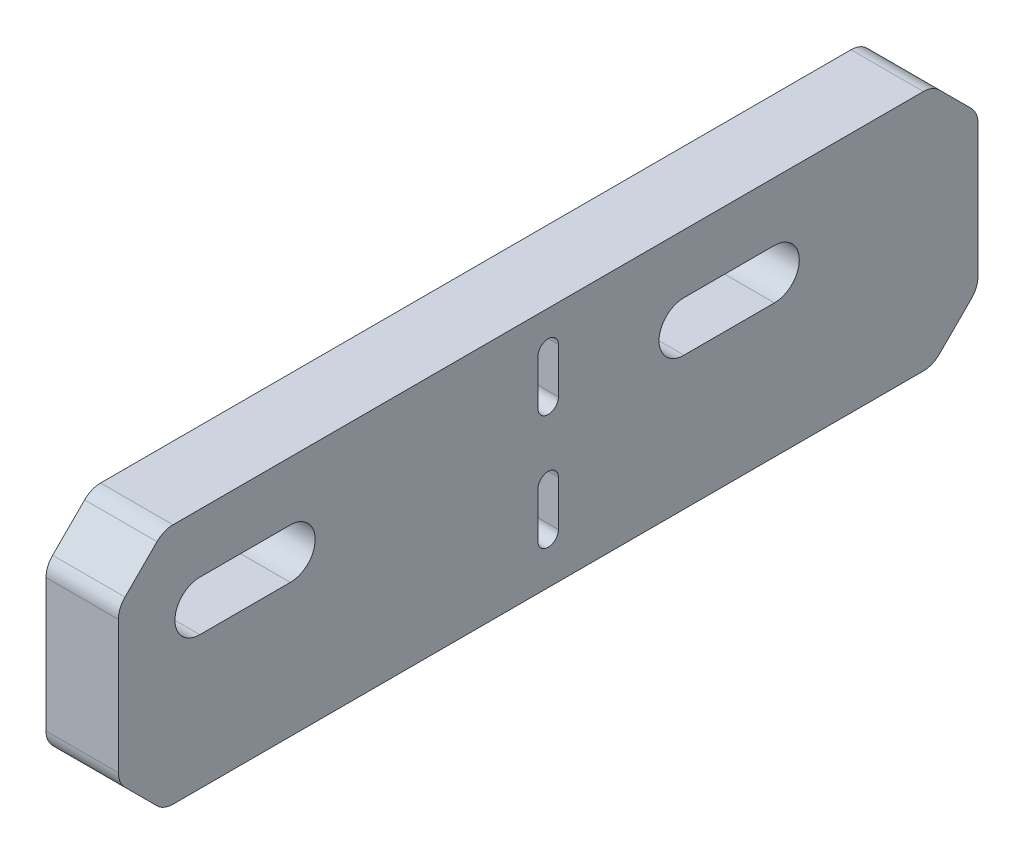
ISO-10303-21;
HEADER;
FILE_DESCRIPTION(('STEP AP214'),'2;1');
FILE_NAME('part.step','',(''),(''),'','','');
FILE_SCHEMA(('AUTOMOTIVE_DESIGN { 1 0 10303 214 1 1 1 1 }'));
ENDSEC;
DATA;
#1=APPLICATION_CONTEXT('core data for automotive mechanical design processes');
#2=APPLICATION_PROTOCOL_DEFINITION('international standard','automotive_design',2000,#1);
#3=PRODUCT_CONTEXT('',#1,'mechanical');
#4=PRODUCT('Part','Part','',(#3));
#5=PRODUCT_RELATED_PRODUCT_CATEGORY('part','',(#4));
#6=PRODUCT_DEFINITION_FORMATION('','',#4);
#7=PRODUCT_DEFINITION_CONTEXT('part definition',#1,'design');
#8=PRODUCT_DEFINITION('design','',#6,#7);
#9=PRODUCT_DEFINITION_SHAPE('','',#8);
#10=(LENGTH_UNIT() NAMED_UNIT(*) SI_UNIT(.MILLI.,.METRE.));
#11=(NAMED_UNIT(*) PLANE_ANGLE_UNIT() SI_UNIT($,.RADIAN.));
#12=(NAMED_UNIT(*) SI_UNIT($,.STERADIAN.) SOLID_ANGLE_UNIT());
#13=UNCERTAINTY_MEASURE_WITH_UNIT(LENGTH_MEASURE(1.E-05),#10,'distance_accuracy_value','');
#14=(GEOMETRIC_REPRESENTATION_CONTEXT(3) GLOBAL_UNCERTAINTY_ASSIGNED_CONTEXT((#13)) GLOBAL_UNIT_ASSIGNED_CONTEXT((#10,
#11,#12)) REPRESENTATION_CONTEXT('',''));
#15=CARTESIAN_POINT('',(0.,0.,0.));
#16=DIRECTION('',(0.,0.,1.));
#17=DIRECTION('',(1.,0.,0.));
#18=AXIS2_PLACEMENT_3D('',#15,#16,#17);
#19=CARTESIAN_POINT('',(8.,10.875,40.));
#20=DIRECTION('',(0.,-1.,0.));
#21=DIRECTION('',(0.,0.,-1.));
#22=AXIS2_PLACEMENT_3D('',#19,#20,#21);
#23=PLANE('',#22);
#24=DIRECTION('',(0.,0.,1.));
#25=VECTOR('',#24,1.);
#26=CARTESIAN_POINT('',(8.,10.875,40.));
#27=LINE('',#26,#25);
#28=CARTESIAN_POINT('',(8.,10.875,-41.4644660940673));
#29=VERTEX_POINT('',#28);
#30=CARTESIAN_POINT('',(8.,10.875,41.4644660940673));
#31=VERTEX_POINT('',#30);
#32=EDGE_CURVE('E389',#29,#31,#27,.T.);
#33=ORIENTED_EDGE('',*,*,#32,.F.);
#34=DIRECTION('',(-1.,0.,0.));
#35=VECTOR('',#34,1.);
#36=CARTESIAN_POINT('',(0.,10.875,-41.4644660940673));
#37=LINE('',#36,#35);
#38=CARTESIAN_POINT('',(0.,10.875,-41.4644660940673));
#39=VERTEX_POINT('',#38);
#40=EDGE_CURVE('E471',#29,#39,#37,.T.);
#41=ORIENTED_EDGE('',*,*,#40,.T.);
#42=DIRECTION('',(0.,0.,1.));
#43=VECTOR('',#42,1.);
#44=CARTESIAN_POINT('',(0.,10.875,40.));
#45=LINE('',#44,#43);
#46=CARTESIAN_POINT('',(0.,10.875,41.4644660940673));
#47=VERTEX_POINT('',#46);
#48=EDGE_CURVE('E382',#39,#47,#45,.T.);
#49=ORIENTED_EDGE('',*,*,#48,.T.);
#50=DIRECTION('',(1.,0.,0.));
#51=VECTOR('',#50,1.);
#52=CARTESIAN_POINT('',(8.,10.875,41.4644660940673));
#53=LINE('',#52,#51);
#54=EDGE_CURVE('E468',#47,#31,#53,.T.);
#55=ORIENTED_EDGE('',*,*,#54,.T.);
#56=EDGE_LOOP('',(#33,#41,#49,#55));
#57=FACE_BOUND('',#56,.T.);
#58=ADVANCED_FACE('F33',(#57),#23,.F.);
#59=CARTESIAN_POINT('',(8.,0.,0.));
#60=DIRECTION('',(1.,0.,0.));
#61=DIRECTION('',(0.,0.,-1.));
#62=AXIS2_PLACEMENT_3D('',#59,#60,#61);
#63=PLANE('',#62);
#64=CARTESIAN_POINT('',(8.,6.825,0.));
#65=DIRECTION('',(1.,0.,0.));
#66=DIRECTION('',(0.,0.,-1.));
#67=AXIS2_PLACEMENT_3D('',#64,#65,#66);
#68=CIRCLE('',#67,1.1303);
#69=CARTESIAN_POINT('',(8.,6.825,-1.1303));
#70=VERTEX_POINT('',#69);
#71=CARTESIAN_POINT('',(8.,6.825,1.1303));
#72=VERTEX_POINT('',#71);
#73=EDGE_CURVE('E282',#70,#72,#68,.T.);
#74=ORIENTED_EDGE('',*,*,#73,.F.);
#75=DIRECTION('',(0.,1.,0.));
#76=VECTOR('',#75,1.);
#77=CARTESIAN_POINT('',(8.,0.,-1.1303));
#78=LINE('',#77,#76);
#79=CARTESIAN_POINT('',(8.,1.825,-1.1303));
#80=VERTEX_POINT('',#79);
#81=EDGE_CURVE('E275',#80,#70,#78,.T.);
#82=ORIENTED_EDGE('',*,*,#81,.F.);
#83=CARTESIAN_POINT('',(8.,1.825,0.));
#84=DIRECTION('',(1.,0.,0.));
#85=DIRECTION('',(0.,0.,-1.));
#86=AXIS2_PLACEMENT_3D('',#83,#84,#85);
#87=CIRCLE('',#86,1.1303);
#88=CARTESIAN_POINT('',(8.,1.825,1.1303));
#89=VERTEX_POINT('',#88);
#90=EDGE_CURVE('E250',#89,#80,#87,.T.);
#91=ORIENTED_EDGE('',*,*,#90,.F.);
#92=DIRECTION('',(0.,-1.,0.));
#93=VECTOR('',#92,1.);
#94=CARTESIAN_POINT('',(8.,0.,1.1303));
#95=LINE('',#94,#93);
#96=EDGE_CURVE('E279',#72,#89,#95,.T.);
#97=ORIENTED_EDGE('',*,*,#96,.F.);
#98=EDGE_LOOP('',(#74,#82,#91,#97));
#99=FACE_BOUND('',#98,.T.);
#100=CARTESIAN_POINT('',(8.,-5.875,0.));
#101=DIRECTION('',(1.,0.,0.));
#102=DIRECTION('',(0.,0.,-1.));
#103=AXIS2_PLACEMENT_3D('',#100,#101,#102);
#104=CIRCLE('',#103,1.1303);
#105=CARTESIAN_POINT('',(8.,-5.875,-1.1303));
#106=VERTEX_POINT('',#105);
#107=CARTESIAN_POINT('',(8.,-5.875,1.1303));
#108=VERTEX_POINT('',#107);
#109=EDGE_CURVE('E311',#106,#108,#104,.T.);
#110=ORIENTED_EDGE('',*,*,#109,.F.);
#111=DIRECTION('',(0.,1.,0.));
#112=VECTOR('',#111,1.);
#113=CARTESIAN_POINT('',(8.,0.,-1.1303));
#114=LINE('',#113,#112);
#115=CARTESIAN_POINT('',(8.,-10.875,-1.1303));
#116=VERTEX_POINT('',#115);
#117=EDGE_CURVE('E299',#116,#106,#114,.T.);
#118=ORIENTED_EDGE('',*,*,#117,.F.);
#119=CARTESIAN_POINT('',(8.,-10.875,0.));
#120=DIRECTION('',(1.,0.,0.));
#121=DIRECTION('',(0.,0.,-1.));
#122=AXIS2_PLACEMENT_3D('',#119,#120,#121);
#123=CIRCLE('',#122,1.1303);
#124=CARTESIAN_POINT('',(8.,-10.875,1.1303));
#125=VERTEX_POINT('',#124);
#126=EDGE_CURVE('E309',#125,#116,#123,.T.);
#127=ORIENTED_EDGE('',*,*,#126,.F.);
#128=DIRECTION('',(0.,-1.,0.));
#129=VECTOR('',#128,1.);
#130=CARTESIAN_POINT('',(8.,0.,1.1303));
#131=LINE('',#130,#129);
#132=EDGE_CURVE('E307',#108,#125,#131,.T.);
#133=ORIENTED_EDGE('',*,*,#132,.F.);
#134=EDGE_LOOP('',(#110,#118,#127,#133));
#135=FACE_BOUND('',#134,.T.);
#136=CARTESIAN_POINT('',(8.,1.62499999999999,-15.));
#137=DIRECTION('',(1.,0.,0.));
#138=DIRECTION('',(0.,0.,-1.));
#139=AXIS2_PLACEMENT_3D('',#136,#137,#138);
#140=CIRCLE('',#139,2.74999999999999);
#141=CARTESIAN_POINT('',(8.,4.37499999999998,-15.));
#142=VERTEX_POINT('',#141);
#143=CARTESIAN_POINT('',(8.,-1.12499999999999,-15.));
#144=VERTEX_POINT('',#143);
#145=EDGE_CURVE('E340',#142,#144,#140,.T.);
#146=ORIENTED_EDGE('',*,*,#145,.F.);
#147=DIRECTION('',(0.,0.,1.));
#148=VECTOR('',#147,1.);
#149=CARTESIAN_POINT('',(8.,4.37499999999998,0.));
#150=LINE('',#149,#148);
#151=CARTESIAN_POINT('',(8.,4.37499999999998,-25.));
#152=VERTEX_POINT('',#151);
#153=EDGE_CURVE('E328',#152,#142,#150,.T.);
#154=ORIENTED_EDGE('',*,*,#153,.F.);
#155=CARTESIAN_POINT('',(8.,1.62499999999999,-25.));
#156=DIRECTION('',(1.,0.,0.));
#157=DIRECTION('',(0.,0.,-1.));
#158=AXIS2_PLACEMENT_3D('',#155,#156,#157);
#159=CIRCLE('',#158,2.74999999999999);
#160=CARTESIAN_POINT('',(8.,-1.12499999999999,-25.));
#161=VERTEX_POINT('',#160);
#162=EDGE_CURVE('E338',#161,#152,#159,.T.);
#163=ORIENTED_EDGE('',*,*,#162,.F.);
#164=DIRECTION('',(0.,0.,-1.));
#165=VECTOR('',#164,1.);
#166=CARTESIAN_POINT('',(8.,-1.12499999999999,0.));
#167=LINE('',#166,#165);
#168=EDGE_CURVE('E336',#144,#161,#167,.T.);
#169=ORIENTED_EDGE('',*,*,#168,.F.);
#170=EDGE_LOOP('',(#146,#154,#163,#169));
#171=FACE_BOUND('',#170,.T.);
#172=CARTESIAN_POINT('',(8.,1.625,38.5));
#173=DIRECTION('',(1.,0.,0.));
#174=DIRECTION('',(0.,0.,-1.));
#175=AXIS2_PLACEMENT_3D('',#172,#173,#174);
#176=CIRCLE('',#175,2.74999999999999);
#177=CARTESIAN_POINT('',(8.,4.37499999999999,38.5));
#178=VERTEX_POINT('',#177);
#179=CARTESIAN_POINT('',(8.,-1.12499999999999,38.5));
#180=VERTEX_POINT('',#179);
#181=EDGE_CURVE('E369',#178,#180,#176,.T.);
#182=ORIENTED_EDGE('',*,*,#181,.F.);
#183=DIRECTION('',(0.,0.,1.));
#184=VECTOR('',#183,1.);
#185=CARTESIAN_POINT('',(8.,4.37499999999997,0.));
#186=LINE('',#185,#184);
#187=CARTESIAN_POINT('',(8.,4.37499999999998,28.5));
#188=VERTEX_POINT('',#187);
#189=EDGE_CURVE('E357',#188,#178,#186,.T.);
#190=ORIENTED_EDGE('',*,*,#189,.F.);
#191=CARTESIAN_POINT('',(8.,1.625,28.5));
#192=DIRECTION('',(1.,0.,0.));
#193=DIRECTION('',(0.,0.,-1.));
#194=AXIS2_PLACEMENT_3D('',#191,#192,#193);
#195=CIRCLE('',#194,2.74999999999999);
#196=CARTESIAN_POINT('',(8.,-1.12499999999999,28.5));
#197=VERTEX_POINT('',#196);
#198=EDGE_CURVE('E367',#197,#188,#195,.T.);
#199=ORIENTED_EDGE('',*,*,#198,.F.);
#200=DIRECTION('',(0.,0.,-1.));
#201=VECTOR('',#200,1.);
#202=CARTESIAN_POINT('',(8.,-1.125,0.));
#203=LINE('',#202,#201);
#204=EDGE_CURVE('E365',#180,#197,#203,.T.);
#205=ORIENTED_EDGE('',*,*,#204,.F.);
#206=EDGE_LOOP('',(#182,#190,#199,#205));
#207=FACE_BOUND('',#206,.T.);
#208=DIRECTION('',(0.,0.,1.));
#209=VECTOR('',#208,1.);
#210=CARTESIAN_POINT('',(8.,-15.875,47.5));
#211=LINE('',#210,#209);
#212=CARTESIAN_POINT('',(8.,-15.875,-41.4644660940673));
#213=VERTEX_POINT('',#212);
#214=CARTESIAN_POINT('',(8.,-15.875,41.4644660940673));
#215=VERTEX_POINT('',#214);
#216=EDGE_CURVE('E375',#213,#215,#211,.T.);
#217=ORIENTED_EDGE('',*,*,#216,.F.);
#218=CARTESIAN_POINT('',(8.,-13.375,-41.4644660940673));
#219=DIRECTION('',(1.,0.,0.));
#220=DIRECTION('',(0.,0.,-1.));
#221=AXIS2_PLACEMENT_3D('',#218,#219,#220);
#222=CIRCLE('',#221,2.5);
#223=CARTESIAN_POINT('',(8.,-15.1427669529664,-43.2322330470336));
#224=VERTEX_POINT('',#223);
#225=EDGE_CURVE('E437',#213,#224,#222,.T.);
#226=ORIENTED_EDGE('',*,*,#225,.T.);
#227=DIRECTION('',(0.,-0.707106781186547,0.707106781186548));
#228=VECTOR('',#227,1.);
#229=CARTESIAN_POINT('',(8.,-29.1875,-29.1874999999999));
#230=LINE('',#229,#228);
#231=CARTESIAN_POINT('',(8.,-11.6072330470336,-46.7677669529664));
#232=VERTEX_POINT('',#231);
#233=EDGE_CURVE('E411',#224,#232,#230,.F.);
#234=ORIENTED_EDGE('',*,*,#233,.T.);
#235=CARTESIAN_POINT('',(8.,-9.83946609406727,-45.));
#236=DIRECTION('',(1.,0.,0.));
#237=DIRECTION('',(0.,0.,-1.));
#238=AXIS2_PLACEMENT_3D('',#235,#236,#237);
#239=CIRCLE('',#238,2.5);
#240=CARTESIAN_POINT('',(8.,-9.83946609406727,-47.5));
#241=VERTEX_POINT('',#240);
#242=EDGE_CURVE('E435',#232,#241,#239,.T.);
#243=ORIENTED_EDGE('',*,*,#242,.T.);
#244=DIRECTION('',(0.,-1.,0.));
#245=VECTOR('',#244,1.);
#246=CARTESIAN_POINT('',(8.,-15.875,-47.5));
#247=LINE('',#246,#245);
#248=CARTESIAN_POINT('',(8.,4.83946609406727,-47.5));
#249=VERTEX_POINT('',#248);
#250=EDGE_CURVE('E372',#249,#241,#247,.T.);
#251=ORIENTED_EDGE('',*,*,#250,.F.);
#252=CARTESIAN_POINT('',(8.,4.83946609406728,-45.));
#253=DIRECTION('',(1.,0.,0.));
#254=DIRECTION('',(0.,0.,-1.));
#255=AXIS2_PLACEMENT_3D('',#252,#253,#254);
#256=CIRCLE('',#255,2.5);
#257=CARTESIAN_POINT('',(8.,6.60723304703364,-46.7677669529664));
#258=VERTEX_POINT('',#257);
#259=EDGE_CURVE('E433',#249,#258,#256,.T.);
#260=ORIENTED_EDGE('',*,*,#259,.T.);
#261=DIRECTION('',(0.,0.707106781186548,0.707106781186547));
#262=VECTOR('',#261,1.);
#263=CARTESIAN_POINT('',(8.,26.6875,-26.6875));
#264=LINE('',#263,#262);
#265=CARTESIAN_POINT('',(8.,10.1427669529664,-43.2322330470336));
#266=VERTEX_POINT('',#265);
#267=EDGE_CURVE('E414',#258,#266,#264,.T.);
#268=ORIENTED_EDGE('',*,*,#267,.T.);
#269=CARTESIAN_POINT('',(8.,8.375,-41.4644660940673));
#270=DIRECTION('',(1.,0.,0.));
#271=DIRECTION('',(0.,0.,-1.));
#272=AXIS2_PLACEMENT_3D('',#269,#270,#271);
#273=CIRCLE('',#272,2.5);
#274=EDGE_CURVE('E431',#266,#29,#273,.T.);
#275=ORIENTED_EDGE('',*,*,#274,.T.);
#276=ORIENTED_EDGE('',*,*,#32,.T.);
#277=CARTESIAN_POINT('',(8.,8.375,41.4644660940673));
#278=DIRECTION('',(1.,0.,0.));
#279=DIRECTION('',(0.,0.,-1.));
#280=AXIS2_PLACEMENT_3D('',#277,#278,#279);
#281=CIRCLE('',#280,2.5);
#282=CARTESIAN_POINT('',(8.,10.1427669529664,43.2322330470336));
#283=VERTEX_POINT('',#282);
#284=EDGE_CURVE('E429',#31,#283,#281,.T.);
#285=ORIENTED_EDGE('',*,*,#284,.T.);
#286=DIRECTION('',(0.,-0.707106781186546,0.707106781186549));
#287=VECTOR('',#286,1.);
#288=CARTESIAN_POINT('',(8.,26.6875,26.6874999999999));
#289=LINE('',#288,#287);
#290=CARTESIAN_POINT('',(8.,6.60723304703367,46.7677669529664));
#291=VERTEX_POINT('',#290);
#292=EDGE_CURVE('E408',#283,#291,#289,.T.);
#293=ORIENTED_EDGE('',*,*,#292,.T.);
#294=CARTESIAN_POINT('',(8.,4.8394660940673,45.));
#295=DIRECTION('',(1.,0.,0.));
#296=DIRECTION('',(0.,0.,-1.));
#297=AXIS2_PLACEMENT_3D('',#294,#295,#296);
#298=CIRCLE('',#297,2.5);
#299=CARTESIAN_POINT('',(8.,4.8394660940673,47.5));
#300=VERTEX_POINT('',#299);
#301=EDGE_CURVE('E427',#291,#300,#298,.T.);
#302=ORIENTED_EDGE('',*,*,#301,.T.);
#303=DIRECTION('',(0.,1.,0.));
#304=VECTOR('',#303,1.);
#305=CARTESIAN_POINT('',(8.,10.875,47.5));
#306=LINE('',#305,#304);
#307=CARTESIAN_POINT('',(8.,-9.83946609406725,47.5));
#308=VERTEX_POINT('',#307);
#309=EDGE_CURVE('E379',#308,#300,#306,.T.);
#310=ORIENTED_EDGE('',*,*,#309,.F.);
#311=CARTESIAN_POINT('',(8.,-9.83946609406725,45.));
#312=DIRECTION('',(1.,0.,0.));
#313=DIRECTION('',(0.,0.,-1.));
#314=AXIS2_PLACEMENT_3D('',#311,#312,#313);
#315=CIRCLE('',#314,2.5);
#316=CARTESIAN_POINT('',(8.,-11.6072330470336,46.7677669529664));
#317=VERTEX_POINT('',#316);
#318=EDGE_CURVE('E425',#308,#317,#315,.T.);
#319=ORIENTED_EDGE('',*,*,#318,.T.);
#320=DIRECTION('',(0.,0.707106781186549,0.707106781186546));
#321=VECTOR('',#320,1.);
#322=CARTESIAN_POINT('',(8.,-29.1875,29.1875000000001));
#323=LINE('',#322,#321);
#324=CARTESIAN_POINT('',(8.,-15.1427669529663,43.2322330470337));
#325=VERTEX_POINT('',#324);
#326=EDGE_CURVE('E405',#317,#325,#323,.F.);
#327=ORIENTED_EDGE('',*,*,#326,.T.);
#328=CARTESIAN_POINT('',(8.,-13.375,41.4644660940673));
#329=DIRECTION('',(1.,0.,0.));
#330=DIRECTION('',(0.,0.,-1.));
#331=AXIS2_PLACEMENT_3D('',#328,#329,#330);
#332=CIRCLE('',#331,2.5);
#333=EDGE_CURVE('E423',#325,#215,#332,.T.);
#334=ORIENTED_EDGE('',*,*,#333,.T.);
#335=EDGE_LOOP('',(#217,#226,#234,#243,#251,#260,#268,#275,#276,#285,#293,#302,#310,#319,#327,#334));
#336=FACE_BOUND('',#335,.T.);
#337=ADVANCED_FACE('F492',(#99,#135,#171,#207,#336),#63,.T.);
#338=CARTESIAN_POINT('',(0.,0.,0.));
#339=DIRECTION('',(1.,0.,0.));
#340=DIRECTION('',(0.,0.,-1.));
#341=AXIS2_PLACEMENT_3D('',#338,#339,#340);
#342=PLANE('',#341);
#343=DIRECTION('',(0.,0.707106781186547,-0.707106781186548));
#344=VECTOR('',#343,1.);
#345=CARTESIAN_POINT('',(0.,-10.875,-47.5));
#346=LINE('',#345,#344);
#347=CARTESIAN_POINT('',(0.,-11.6072330470336,-46.7677669529664));
#348=VERTEX_POINT('',#347);
#349=CARTESIAN_POINT('',(0.,-15.1427669529664,-43.2322330470336));
#350=VERTEX_POINT('',#349);
#351=EDGE_CURVE('E399',#348,#350,#346,.F.);
#352=ORIENTED_EDGE('',*,*,#351,.T.);
#353=CARTESIAN_POINT('',(0.,-13.375,-41.4644660940673));
#354=DIRECTION('',(1.,0.,0.));
#355=DIRECTION('',(0.,0.,-1.));
#356=AXIS2_PLACEMENT_3D('',#353,#354,#355);
#357=CIRCLE('',#356,2.5);
#358=CARTESIAN_POINT('',(0.,-15.875,-41.4644660940673));
#359=VERTEX_POINT('',#358);
#360=EDGE_CURVE('E456',#350,#359,#357,.F.);
#361=ORIENTED_EDGE('',*,*,#360,.T.);
#362=DIRECTION('',(0.,0.,1.));
#363=VECTOR('',#362,1.);
#364=CARTESIAN_POINT('',(0.,-15.875,47.5));
#365=LINE('',#364,#363);
#366=CARTESIAN_POINT('',(0.,-15.875,41.4644660940673));
#367=VERTEX_POINT('',#366);
#368=EDGE_CURVE('E385',#359,#367,#365,.T.);
#369=ORIENTED_EDGE('',*,*,#368,.T.);
#370=CARTESIAN_POINT('',(0.,-13.375,41.4644660940673));
#371=DIRECTION('',(1.,0.,0.));
#372=DIRECTION('',(0.,0.,-1.));
#373=AXIS2_PLACEMENT_3D('',#370,#371,#372);
#374=CIRCLE('',#373,2.5);
#375=CARTESIAN_POINT('',(0.,-15.1427669529663,43.2322330470337));
#376=VERTEX_POINT('',#375);
#377=EDGE_CURVE('E443',#367,#376,#374,.F.);
#378=ORIENTED_EDGE('',*,*,#377,.T.);
#379=DIRECTION('',(0.,-0.707106781186549,-0.707106781186546));
#380=VECTOR('',#379,1.);
#381=CARTESIAN_POINT('',(0.,-15.875,42.5));
#382=LINE('',#381,#380);
#383=CARTESIAN_POINT('',(0.,-11.6072330470336,46.7677669529664));
#384=VERTEX_POINT('',#383);
#385=EDGE_CURVE('E392',#376,#384,#382,.F.);
#386=ORIENTED_EDGE('',*,*,#385,.T.);
#387=CARTESIAN_POINT('',(0.,-9.83946609406725,45.));
#388=DIRECTION('',(1.,0.,0.));
#389=DIRECTION('',(0.,0.,-1.));
#390=AXIS2_PLACEMENT_3D('',#387,#388,#389);
#391=CIRCLE('',#390,2.5);
#392=CARTESIAN_POINT('',(0.,-9.83946609406725,47.5));
#393=VERTEX_POINT('',#392);
#394=EDGE_CURVE('E445',#384,#393,#391,.F.);
#395=ORIENTED_EDGE('',*,*,#394,.T.);
#396=DIRECTION('',(0.,1.,0.));
#397=VECTOR('',#396,1.);
#398=CARTESIAN_POINT('',(0.,10.875,47.5));
#399=LINE('',#398,#397);
#400=CARTESIAN_POINT('',(0.,4.8394660940673,47.5));
#401=VERTEX_POINT('',#400);
#402=EDGE_CURVE('E376',#393,#401,#399,.T.);
#403=ORIENTED_EDGE('',*,*,#402,.T.);
#404=CARTESIAN_POINT('',(0.,4.8394660940673,45.));
#405=DIRECTION('',(1.,0.,0.));
#406=DIRECTION('',(0.,0.,-1.));
#407=AXIS2_PLACEMENT_3D('',#404,#405,#406);
#408=CIRCLE('',#407,2.5);
#409=CARTESIAN_POINT('',(0.,6.60723304703367,46.7677669529664));
#410=VERTEX_POINT('',#409);
#411=EDGE_CURVE('E55',#401,#410,#408,.F.);
#412=ORIENTED_EDGE('',*,*,#411,.T.);
#413=DIRECTION('',(0.,0.707106781186546,-0.707106781186549));
#414=VECTOR('',#413,1.);
#415=CARTESIAN_POINT('',(0.,5.87500000000003,47.5));
#416=LINE('',#415,#414);
#417=CARTESIAN_POINT('',(0.,10.1427669529664,43.2322330470336));
#418=VERTEX_POINT('',#417);
#419=EDGE_CURVE('E397',#410,#418,#416,.T.);
#420=ORIENTED_EDGE('',*,*,#419,.T.);
#421=CARTESIAN_POINT('',(0.,8.375,41.4644660940673));
#422=DIRECTION('',(1.,0.,0.));
#423=DIRECTION('',(0.,0.,-1.));
#424=AXIS2_PLACEMENT_3D('',#421,#422,#423);
#425=CIRCLE('',#424,2.5);
#426=EDGE_CURVE('E448',#418,#47,#425,.F.);
#427=ORIENTED_EDGE('',*,*,#426,.T.);
#428=ORIENTED_EDGE('',*,*,#48,.F.);
#429=CARTESIAN_POINT('',(0.,8.375,-41.4644660940673));
#430=DIRECTION('',(1.,0.,0.));
#431=DIRECTION('',(0.,0.,-1.));
#432=AXIS2_PLACEMENT_3D('',#429,#430,#431);
#433=CIRCLE('',#432,2.5);
#434=CARTESIAN_POINT('',(0.,10.1427669529664,-43.2322330470336));
#435=VERTEX_POINT('',#434);
#436=EDGE_CURVE('E450',#39,#435,#433,.F.);
#437=ORIENTED_EDGE('',*,*,#436,.T.);
#438=DIRECTION('',(0.,-0.707106781186548,-0.707106781186547));
#439=VECTOR('',#438,1.);
#440=CARTESIAN_POINT('',(0.,10.875,-42.5));
#441=LINE('',#440,#439);
#442=CARTESIAN_POINT('',(0.,6.60723304703364,-46.7677669529664));
#443=VERTEX_POINT('',#442);
#444=EDGE_CURVE('E402',#435,#443,#441,.T.);
#445=ORIENTED_EDGE('',*,*,#444,.T.);
#446=CARTESIAN_POINT('',(0.,4.83946609406728,-45.));
#447=DIRECTION('',(1.,0.,0.));
#448=DIRECTION('',(0.,0.,-1.));
#449=AXIS2_PLACEMENT_3D('',#446,#447,#448);
#450=CIRCLE('',#449,2.5);
#451=CARTESIAN_POINT('',(0.,4.83946609406727,-47.5));
#452=VERTEX_POINT('',#451);
#453=EDGE_CURVE('E452',#443,#452,#450,.F.);
#454=ORIENTED_EDGE('',*,*,#453,.T.);
#455=DIRECTION('',(0.,-1.,0.));
#456=VECTOR('',#455,1.);
#457=CARTESIAN_POINT('',(0.,-15.875,-47.5));
#458=LINE('',#457,#456);
#459=CARTESIAN_POINT('',(0.,-9.83946609406727,-47.5));
#460=VERTEX_POINT('',#459);
#461=EDGE_CURVE('E371',#452,#460,#458,.T.);
#462=ORIENTED_EDGE('',*,*,#461,.T.);
#463=CARTESIAN_POINT('',(0.,-9.83946609406727,-45.));
#464=DIRECTION('',(1.,0.,0.));
#465=DIRECTION('',(0.,0.,-1.));
#466=AXIS2_PLACEMENT_3D('',#463,#464,#465);
#467=CIRCLE('',#466,2.5);
#468=EDGE_CURVE('E454',#460,#348,#467,.F.);
#469=ORIENTED_EDGE('',*,*,#468,.T.);
#470=EDGE_LOOP('',(#352,#361,#369,#378,#386,#395,#403,#412,#420,#427,#428,#437,#445,#454,#462,#469));
#471=FACE_BOUND('',#470,.T.);
#472=DIRECTION('',(0.,-1.,0.));
#473=VECTOR('',#472,1.);
#474=CARTESIAN_POINT('',(0.,-5.875,-1.1303));
#475=LINE('',#474,#473);
#476=CARTESIAN_POINT('',(0.,-5.875,-1.1303));
#477=VERTEX_POINT('',#476);
#478=CARTESIAN_POINT('',(0.,-10.875,-1.1303));
#479=VERTEX_POINT('',#478);
#480=EDGE_CURVE('E287',#477,#479,#475,.T.);
#481=ORIENTED_EDGE('',*,*,#480,.F.);
#482=CARTESIAN_POINT('',(0.,-5.875,0.));
#483=DIRECTION('',(-1.,0.,0.));
#484=DIRECTION('',(0.,0.,1.));
#485=AXIS2_PLACEMENT_3D('',#482,#483,#484);
#486=CIRCLE('',#485,1.1303);
#487=CARTESIAN_POINT('',(0.,-5.875,1.1303));
#488=VERTEX_POINT('',#487);
#489=EDGE_CURVE('E284',#488,#477,#486,.T.);
#490=ORIENTED_EDGE('',*,*,#489,.F.);
#491=DIRECTION('',(0.,1.,0.));
#492=VECTOR('',#491,1.);
#493=CARTESIAN_POINT('',(0.,-5.875,1.1303));
#494=LINE('',#493,#492);
#495=CARTESIAN_POINT('',(0.,-10.875,1.1303));
#496=VERTEX_POINT('',#495);
#497=EDGE_CURVE('E293',#496,#488,#494,.T.);
#498=ORIENTED_EDGE('',*,*,#497,.F.);
#499=CARTESIAN_POINT('',(0.,-10.875,0.));
#500=DIRECTION('',(-1.,0.,0.));
#501=DIRECTION('',(0.,0.,1.));
#502=AXIS2_PLACEMENT_3D('',#499,#500,#501);
#503=CIRCLE('',#502,1.1303);
#504=EDGE_CURVE('E290',#479,#496,#503,.T.);
#505=ORIENTED_EDGE('',*,*,#504,.F.);
#506=EDGE_LOOP('',(#481,#490,#498,#505));
#507=FACE_BOUND('',#506,.T.);
#508=DIRECTION('',(0.,-1.,0.));
#509=VECTOR('',#508,1.);
#510=CARTESIAN_POINT('',(0.,6.825,-1.1303));
#511=LINE('',#510,#509);
#512=CARTESIAN_POINT('',(0.,6.825,-1.1303));
#513=VERTEX_POINT('',#512);
#514=CARTESIAN_POINT('',(0.,1.825,-1.1303));
#515=VERTEX_POINT('',#514);
#516=EDGE_CURVE('E257',#513,#515,#511,.T.);
#517=ORIENTED_EDGE('',*,*,#516,.F.);
#518=CARTESIAN_POINT('',(0.,6.825,0.));
#519=DIRECTION('',(-1.,0.,0.));
#520=DIRECTION('',(0.,0.,1.));
#521=AXIS2_PLACEMENT_3D('',#518,#519,#520);
#522=CIRCLE('',#521,1.1303);
#523=CARTESIAN_POINT('',(0.,6.825,1.1303));
#524=VERTEX_POINT('',#523);
#525=EDGE_CURVE('E263',#524,#513,#522,.T.);
#526=ORIENTED_EDGE('',*,*,#525,.F.);
#527=DIRECTION('',(0.,1.,0.));
#528=VECTOR('',#527,1.);
#529=CARTESIAN_POINT('',(0.,6.825,1.1303));
#530=LINE('',#529,#528);
#531=CARTESIAN_POINT('',(0.,1.825,1.1303));
#532=VERTEX_POINT('',#531);
#533=EDGE_CURVE('E267',#532,#524,#530,.T.);
#534=ORIENTED_EDGE('',*,*,#533,.F.);
#535=CARTESIAN_POINT('',(0.,1.825,0.));
#536=DIRECTION('',(-1.,0.,0.));
#537=DIRECTION('',(0.,0.,1.));
#538=AXIS2_PLACEMENT_3D('',#535,#536,#537);
#539=CIRCLE('',#538,1.1303);
#540=EDGE_CURVE('E247',#515,#532,#539,.T.);
#541=ORIENTED_EDGE('',*,*,#540,.F.);
#542=EDGE_LOOP('',(#517,#526,#534,#541));
#543=FACE_BOUND('',#542,.T.);
#544=DIRECTION('',(0.,0.,-1.));
#545=VECTOR('',#544,1.);
#546=CARTESIAN_POINT('',(0.,4.37499999999998,-15.));
#547=LINE('',#546,#545);
#548=CARTESIAN_POINT('',(0.,4.37499999999998,-15.));
#549=VERTEX_POINT('',#548);
#550=CARTESIAN_POINT('',(0.,4.37499999999998,-25.));
#551=VERTEX_POINT('',#550);
#552=EDGE_CURVE('E316',#549,#551,#547,.T.);
#553=ORIENTED_EDGE('',*,*,#552,.F.);
#554=CARTESIAN_POINT('',(0.,1.62499999999999,-15.));
#555=DIRECTION('',(-1.,0.,0.));
#556=DIRECTION('',(0.,0.,1.));
#557=AXIS2_PLACEMENT_3D('',#554,#555,#556);
#558=CIRCLE('',#557,2.74999999999999);
#559=CARTESIAN_POINT('',(0.,-1.12499999999999,-15.));
#560=VERTEX_POINT('',#559);
#561=EDGE_CURVE('E313',#560,#549,#558,.T.);
#562=ORIENTED_EDGE('',*,*,#561,.F.);
#563=DIRECTION('',(0.,0.,1.));
#564=VECTOR('',#563,1.);
#565=CARTESIAN_POINT('',(0.,-1.12499999999999,-15.));
#566=LINE('',#565,#564);
#567=CARTESIAN_POINT('',(0.,-1.12499999999999,-25.));
#568=VERTEX_POINT('',#567);
#569=EDGE_CURVE('E322',#568,#560,#566,.T.);
#570=ORIENTED_EDGE('',*,*,#569,.F.);
#571=CARTESIAN_POINT('',(0.,1.62499999999999,-25.));
#572=DIRECTION('',(-1.,0.,0.));
#573=DIRECTION('',(0.,0.,1.));
#574=AXIS2_PLACEMENT_3D('',#571,#572,#573);
#575=CIRCLE('',#574,2.74999999999999);
#576=EDGE_CURVE('E319',#551,#568,#575,.T.);
#577=ORIENTED_EDGE('',*,*,#576,.F.);
#578=EDGE_LOOP('',(#553,#562,#570,#577));
#579=FACE_BOUND('',#578,.T.);
#580=DIRECTION('',(0.,0.,-1.));
#581=VECTOR('',#580,1.);
#582=CARTESIAN_POINT('',(0.,4.37499999999999,38.5));
#583=LINE('',#582,#581);
#584=CARTESIAN_POINT('',(0.,4.37499999999999,38.5));
#585=VERTEX_POINT('',#584);
#586=CARTESIAN_POINT('',(0.,4.37499999999998,28.5));
#587=VERTEX_POINT('',#586);
#588=EDGE_CURVE('E345',#585,#587,#583,.T.);
#589=ORIENTED_EDGE('',*,*,#588,.F.);
#590=CARTESIAN_POINT('',(0.,1.625,38.5));
#591=DIRECTION('',(-1.,0.,0.));
#592=DIRECTION('',(0.,0.,1.));
#593=AXIS2_PLACEMENT_3D('',#590,#591,#592);
#594=CIRCLE('',#593,2.74999999999999);
#595=CARTESIAN_POINT('',(0.,-1.12499999999999,38.5));
#596=VERTEX_POINT('',#595);
#597=EDGE_CURVE('E342',#596,#585,#594,.T.);
#598=ORIENTED_EDGE('',*,*,#597,.F.);
#599=DIRECTION('',(0.,0.,1.));
#600=VECTOR('',#599,1.);
#601=CARTESIAN_POINT('',(0.,-1.12499999999999,38.5));
#602=LINE('',#601,#600);
#603=CARTESIAN_POINT('',(0.,-1.12499999999999,28.5));
#604=VERTEX_POINT('',#603);
#605=EDGE_CURVE('E351',#604,#596,#602,.T.);
#606=ORIENTED_EDGE('',*,*,#605,.F.);
#607=CARTESIAN_POINT('',(0.,1.625,28.5));
#608=DIRECTION('',(-1.,0.,0.));
#609=DIRECTION('',(0.,0.,1.));
#610=AXIS2_PLACEMENT_3D('',#607,#608,#609);
#611=CIRCLE('',#610,2.74999999999999);
#612=EDGE_CURVE('E348',#587,#604,#611,.T.);
#613=ORIENTED_EDGE('',*,*,#612,.F.);
#614=EDGE_LOOP('',(#589,#598,#606,#613));
#615=FACE_BOUND('',#614,.T.);
#616=ADVANCED_FACE('F265',(#471,#507,#543,#579,#615),#342,.F.);
#617=CARTESIAN_POINT('',(8.,10.875,47.5));
#618=DIRECTION('',(0.,0.,1.));
#619=DIRECTION('',(1.,0.,0.));
#620=AXIS2_PLACEMENT_3D('',#617,#618,#619);
#621=PLANE('',#620);
#622=ORIENTED_EDGE('',*,*,#309,.T.);
#623=DIRECTION('',(-1.,0.,0.));
#624=VECTOR('',#623,1.);
#625=CARTESIAN_POINT('',(8.,4.8394660940673,47.5));
#626=LINE('',#625,#624);
#627=EDGE_CURVE('E480',#300,#401,#626,.T.);
#628=ORIENTED_EDGE('',*,*,#627,.T.);
#629=ORIENTED_EDGE('',*,*,#402,.F.);
#630=DIRECTION('',(-1.,0.,0.));
#631=VECTOR('',#630,1.);
#632=CARTESIAN_POINT('',(8.,-9.83946609406725,47.5));
#633=LINE('',#632,#631);
#634=EDGE_CURVE('E477',#393,#308,#633,.F.);
#635=ORIENTED_EDGE('',*,*,#634,.T.);
#636=EDGE_LOOP('',(#622,#628,#629,#635));
#637=FACE_BOUND('',#636,.T.);
#638=ADVANCED_FACE('F545',(#637),#621,.T.);
#639=CARTESIAN_POINT('',(8.,-15.875,47.5));
#640=DIRECTION('',(0.,-1.,0.));
#641=DIRECTION('',(0.,0.,-1.));
#642=AXIS2_PLACEMENT_3D('',#639,#640,#641);
#643=PLANE('',#642);
#644=ORIENTED_EDGE('',*,*,#368,.F.);
#645=DIRECTION('',(-1.,0.,0.));
#646=VECTOR('',#645,1.);
#647=CARTESIAN_POINT('',(8.,-15.875,-41.4644660940673));
#648=LINE('',#647,#646);
#649=EDGE_CURVE('E420',#359,#213,#648,.F.);
#650=ORIENTED_EDGE('',*,*,#649,.T.);
#651=ORIENTED_EDGE('',*,*,#216,.T.);
#652=DIRECTION('',(1.,0.,0.));
#653=VECTOR('',#652,1.);
#654=CARTESIAN_POINT('',(8.,-15.875,41.4644660940673));
#655=LINE('',#654,#653);
#656=EDGE_CURVE('E417',#215,#367,#655,.F.);
#657=ORIENTED_EDGE('',*,*,#656,.T.);
#658=EDGE_LOOP('',(#644,#650,#651,#657));
#659=FACE_BOUND('',#658,.T.);
#660=ADVANCED_FACE('F497',(#659),#643,.T.);
#661=CARTESIAN_POINT('',(8.,-15.875,-47.5));
#662=DIRECTION('',(0.,0.,-1.));
#663=DIRECTION('',(-1.,0.,0.));
#664=AXIS2_PLACEMENT_3D('',#661,#662,#663);
#665=PLANE('',#664);
#666=ORIENTED_EDGE('',*,*,#250,.T.);
#667=DIRECTION('',(1.,0.,0.));
#668=VECTOR('',#667,1.);
#669=CARTESIAN_POINT('',(8.,-9.83946609406727,-47.5));
#670=LINE('',#669,#668);
#671=EDGE_CURVE('E461',#241,#460,#670,.F.);
#672=ORIENTED_EDGE('',*,*,#671,.T.);
#673=ORIENTED_EDGE('',*,*,#461,.F.);
#674=DIRECTION('',(1.,0.,0.));
#675=VECTOR('',#674,1.);
#676=CARTESIAN_POINT('',(8.,4.83946609406728,-47.5));
#677=LINE('',#676,#675);
#678=EDGE_CURVE('E458',#452,#249,#677,.T.);
#679=ORIENTED_EDGE('',*,*,#678,.T.);
#680=EDGE_LOOP('',(#666,#672,#673,#679));
#681=FACE_BOUND('',#680,.T.);
#682=ADVANCED_FACE('F515',(#681),#665,.T.);
#683=CARTESIAN_POINT('',(10.,-1.12499999999999,38.5));
#684=DIRECTION('',(0.,-1.,0.));
#685=DIRECTION('',(0.,0.,-1.));
#686=AXIS2_PLACEMENT_3D('',#683,#684,#685);
#687=PLANE('',#686);
#688=ORIENTED_EDGE('',*,*,#204,.T.);
#689=DIRECTION('',(-1.,0.,0.));
#690=VECTOR('',#689,1.);
#691=CARTESIAN_POINT('',(10.,-1.12499999999999,28.5));
#692=LINE('',#691,#690);
#693=EDGE_CURVE('E358',#197,#604,#692,.T.);
#694=ORIENTED_EDGE('',*,*,#693,.T.);
#695=ORIENTED_EDGE('',*,*,#605,.T.);
#696=DIRECTION('',(-1.,0.,0.));
#697=VECTOR('',#696,1.);
#698=CARTESIAN_POINT('',(10.,-1.12499999999999,38.5));
#699=LINE('',#698,#697);
#700=EDGE_CURVE('E354',#180,#596,#699,.T.);
#701=ORIENTED_EDGE('',*,*,#700,.F.);
#702=EDGE_LOOP('',(#688,#694,#695,#701));
#703=FACE_BOUND('',#702,.T.);
#704=ADVANCED_FACE('F776',(#703),#687,.F.);
#705=CARTESIAN_POINT('',(10.,4.37499999999999,38.5));
#706=DIRECTION('',(0.,1.,0.));
#707=DIRECTION('',(0.,0.,1.));
#708=AXIS2_PLACEMENT_3D('',#705,#706,#707);
#709=PLANE('',#708);
#710=ORIENTED_EDGE('',*,*,#189,.T.);
#711=DIRECTION('',(-1.,0.,0.));
#712=VECTOR('',#711,1.);
#713=CARTESIAN_POINT('',(10.,4.37499999999999,38.5));
#714=LINE('',#713,#712);
#715=EDGE_CURVE('E353',#178,#585,#714,.T.);
#716=ORIENTED_EDGE('',*,*,#715,.T.);
#717=ORIENTED_EDGE('',*,*,#588,.T.);
#718=DIRECTION('',(-1.,0.,0.));
#719=VECTOR('',#718,1.);
#720=CARTESIAN_POINT('',(10.,4.37499999999998,28.5));
#721=LINE('',#720,#719);
#722=EDGE_CURVE('E360',#188,#587,#721,.T.);
#723=ORIENTED_EDGE('',*,*,#722,.F.);
#724=EDGE_LOOP('',(#710,#716,#717,#723));
#725=FACE_BOUND('',#724,.T.);
#726=ADVANCED_FACE('F767',(#725),#709,.F.);
#727=CARTESIAN_POINT('',(10.,1.625,38.5));
#728=DIRECTION('',(-1.,0.,0.));
#729=DIRECTION('',(0.,0.,1.));
#730=AXIS2_PLACEMENT_3D('',#727,#728,#729);
#731=CYLINDRICAL_SURFACE('',#730,2.74999999999999);
#732=ORIENTED_EDGE('',*,*,#181,.T.);
#733=ORIENTED_EDGE('',*,*,#700,.T.);
#734=ORIENTED_EDGE('',*,*,#597,.T.);
#735=ORIENTED_EDGE('',*,*,#715,.F.);
#736=EDGE_LOOP('',(#732,#733,#734,#735));
#737=FACE_BOUND('',#736,.T.);
#738=ADVANCED_FACE('F758',(#737),#731,.F.);
#739=CARTESIAN_POINT('',(10.,1.625,28.5));
#740=DIRECTION('',(-1.,0.,0.));
#741=DIRECTION('',(0.,0.,1.));
#742=AXIS2_PLACEMENT_3D('',#739,#740,#741);
#743=CYLINDRICAL_SURFACE('',#742,2.74999999999999);
#744=ORIENTED_EDGE('',*,*,#198,.T.);
#745=ORIENTED_EDGE('',*,*,#722,.T.);
#746=ORIENTED_EDGE('',*,*,#612,.T.);
#747=ORIENTED_EDGE('',*,*,#693,.F.);
#748=EDGE_LOOP('',(#744,#745,#746,#747));
#749=FACE_BOUND('',#748,.T.);
#750=ADVANCED_FACE('F749',(#749),#743,.F.);
#751=CARTESIAN_POINT('',(10.,-1.12499999999999,-15.));
#752=DIRECTION('',(0.,-1.,0.));
#753=DIRECTION('',(0.,0.,-1.));
#754=AXIS2_PLACEMENT_3D('',#751,#752,#753);
#755=PLANE('',#754);
#756=ORIENTED_EDGE('',*,*,#168,.T.);
#757=DIRECTION('',(-1.,0.,0.));
#758=VECTOR('',#757,1.);
#759=CARTESIAN_POINT('',(10.,-1.12499999999999,-25.));
#760=LINE('',#759,#758);
#761=EDGE_CURVE('E329',#161,#568,#760,.T.);
#762=ORIENTED_EDGE('',*,*,#761,.T.);
#763=ORIENTED_EDGE('',*,*,#569,.T.);
#764=DIRECTION('',(-1.,0.,0.));
#765=VECTOR('',#764,1.);
#766=CARTESIAN_POINT('',(10.,-1.12499999999999,-15.));
#767=LINE('',#766,#765);
#768=EDGE_CURVE('E325',#144,#560,#767,.T.);
#769=ORIENTED_EDGE('',*,*,#768,.F.);
#770=EDGE_LOOP('',(#756,#762,#763,#769));
#771=FACE_BOUND('',#770,.T.);
#772=ADVANCED_FACE('F740',(#771),#755,.F.);
#773=CARTESIAN_POINT('',(10.,4.37499999999998,-15.));
#774=DIRECTION('',(0.,1.,0.));
#775=DIRECTION('',(0.,0.,1.));
#776=AXIS2_PLACEMENT_3D('',#773,#774,#775);
#777=PLANE('',#776);
#778=ORIENTED_EDGE('',*,*,#153,.T.);
#779=DIRECTION('',(-1.,0.,0.));
#780=VECTOR('',#779,1.);
#781=CARTESIAN_POINT('',(10.,4.37499999999998,-15.));
#782=LINE('',#781,#780);
#783=EDGE_CURVE('E324',#142,#549,#782,.T.);
#784=ORIENTED_EDGE('',*,*,#783,.T.);
#785=ORIENTED_EDGE('',*,*,#552,.T.);
#786=DIRECTION('',(-1.,0.,0.));
#787=VECTOR('',#786,1.);
#788=CARTESIAN_POINT('',(10.,4.37499999999998,-25.));
#789=LINE('',#788,#787);
#790=EDGE_CURVE('E331',#152,#551,#789,.T.);
#791=ORIENTED_EDGE('',*,*,#790,.F.);
#792=EDGE_LOOP('',(#778,#784,#785,#791));
#793=FACE_BOUND('',#792,.T.);
#794=ADVANCED_FACE('F731',(#793),#777,.F.);
#795=CARTESIAN_POINT('',(10.,1.62499999999999,-15.));
#796=DIRECTION('',(-1.,0.,0.));
#797=DIRECTION('',(0.,0.,1.));
#798=AXIS2_PLACEMENT_3D('',#795,#796,#797);
#799=CYLINDRICAL_SURFACE('',#798,2.74999999999999);
#800=ORIENTED_EDGE('',*,*,#145,.T.);
#801=ORIENTED_EDGE('',*,*,#768,.T.);
#802=ORIENTED_EDGE('',*,*,#561,.T.);
#803=ORIENTED_EDGE('',*,*,#783,.F.);
#804=EDGE_LOOP('',(#800,#801,#802,#803));
#805=FACE_BOUND('',#804,.T.);
#806=ADVANCED_FACE('F722',(#805),#799,.F.);
#807=CARTESIAN_POINT('',(10.,1.62499999999999,-25.));
#808=DIRECTION('',(-1.,0.,0.));
#809=DIRECTION('',(0.,0.,1.));
#810=AXIS2_PLACEMENT_3D('',#807,#808,#809);
#811=CYLINDRICAL_SURFACE('',#810,2.74999999999999);
#812=ORIENTED_EDGE('',*,*,#162,.T.);
#813=ORIENTED_EDGE('',*,*,#790,.T.);
#814=ORIENTED_EDGE('',*,*,#576,.T.);
#815=ORIENTED_EDGE('',*,*,#761,.F.);
#816=EDGE_LOOP('',(#812,#813,#814,#815));
#817=FACE_BOUND('',#816,.T.);
#818=ADVANCED_FACE('F713',(#817),#811,.F.);
#819=CARTESIAN_POINT('',(10.,-5.875,1.1303));
#820=DIRECTION('',(0.,0.,1.));
#821=DIRECTION('',(0.,-1.,0.));
#822=AXIS2_PLACEMENT_3D('',#819,#820,#821);
#823=PLANE('',#822);
#824=ORIENTED_EDGE('',*,*,#132,.T.);
#825=DIRECTION('',(-1.,0.,0.));
#826=VECTOR('',#825,1.);
#827=CARTESIAN_POINT('',(10.,-10.875,1.1303));
#828=LINE('',#827,#826);
#829=EDGE_CURVE('E300',#125,#496,#828,.T.);
#830=ORIENTED_EDGE('',*,*,#829,.T.);
#831=ORIENTED_EDGE('',*,*,#497,.T.);
#832=DIRECTION('',(-1.,0.,0.));
#833=VECTOR('',#832,1.);
#834=CARTESIAN_POINT('',(10.,-5.875,1.1303));
#835=LINE('',#834,#833);
#836=EDGE_CURVE('E296',#108,#488,#835,.T.);
#837=ORIENTED_EDGE('',*,*,#836,.F.);
#838=EDGE_LOOP('',(#824,#830,#831,#837));
#839=FACE_BOUND('',#838,.T.);
#840=ADVANCED_FACE('F704',(#839),#823,.F.);
#841=CARTESIAN_POINT('',(10.,-5.875,-1.1303));
#842=DIRECTION('',(0.,0.,-1.));
#843=DIRECTION('',(0.,1.,0.));
#844=AXIS2_PLACEMENT_3D('',#841,#842,#843);
#845=PLANE('',#844);
#846=ORIENTED_EDGE('',*,*,#117,.T.);
#847=DIRECTION('',(-1.,0.,0.));
#848=VECTOR('',#847,1.);
#849=CARTESIAN_POINT('',(10.,-5.875,-1.1303));
#850=LINE('',#849,#848);
#851=EDGE_CURVE('E295',#106,#477,#850,.T.);
#852=ORIENTED_EDGE('',*,*,#851,.T.);
#853=ORIENTED_EDGE('',*,*,#480,.T.);
#854=DIRECTION('',(-1.,0.,0.));
#855=VECTOR('',#854,1.);
#856=CARTESIAN_POINT('',(10.,-10.875,-1.1303));
#857=LINE('',#856,#855);
#858=EDGE_CURVE('E302',#116,#479,#857,.T.);
#859=ORIENTED_EDGE('',*,*,#858,.F.);
#860=EDGE_LOOP('',(#846,#852,#853,#859));
#861=FACE_BOUND('',#860,.T.);
#862=ADVANCED_FACE('F695',(#861),#845,.F.);
#863=CARTESIAN_POINT('',(10.,-5.875,0.));
#864=DIRECTION('',(-1.,0.,0.));
#865=DIRECTION('',(0.,0.,1.));
#866=AXIS2_PLACEMENT_3D('',#863,#864,#865);
#867=CYLINDRICAL_SURFACE('',#866,1.1303);
#868=ORIENTED_EDGE('',*,*,#109,.T.);
#869=ORIENTED_EDGE('',*,*,#836,.T.);
#870=ORIENTED_EDGE('',*,*,#489,.T.);
#871=ORIENTED_EDGE('',*,*,#851,.F.);
#872=EDGE_LOOP('',(#868,#869,#870,#871));
#873=FACE_BOUND('',#872,.T.);
#874=ADVANCED_FACE('F686',(#873),#867,.F.);
#875=CARTESIAN_POINT('',(10.,-10.875,0.));
#876=DIRECTION('',(-1.,0.,0.));
#877=DIRECTION('',(0.,0.,1.));
#878=AXIS2_PLACEMENT_3D('',#875,#876,#877);
#879=CYLINDRICAL_SURFACE('',#878,1.1303);
#880=ORIENTED_EDGE('',*,*,#126,.T.);
#881=ORIENTED_EDGE('',*,*,#858,.T.);
#882=ORIENTED_EDGE('',*,*,#504,.T.);
#883=ORIENTED_EDGE('',*,*,#829,.F.);
#884=EDGE_LOOP('',(#880,#881,#882,#883));
#885=FACE_BOUND('',#884,.T.);
#886=ADVANCED_FACE('F677',(#885),#879,.F.);
#887=CARTESIAN_POINT('',(10.,6.825,1.1303));
#888=DIRECTION('',(0.,0.,1.));
#889=DIRECTION('',(0.,-1.,0.));
#890=AXIS2_PLACEMENT_3D('',#887,#888,#889);
#891=PLANE('',#890);
#892=ORIENTED_EDGE('',*,*,#96,.T.);
#893=DIRECTION('',(-1.,0.,0.));
#894=VECTOR('',#893,1.);
#895=CARTESIAN_POINT('',(10.,1.825,1.1303));
#896=LINE('',#895,#894);
#897=EDGE_CURVE('E253',#89,#532,#896,.T.);
#898=ORIENTED_EDGE('',*,*,#897,.T.);
#899=ORIENTED_EDGE('',*,*,#533,.T.);
#900=DIRECTION('',(-1.,0.,0.));
#901=VECTOR('',#900,1.);
#902=CARTESIAN_POINT('',(10.,6.825,1.1303));
#903=LINE('',#902,#901);
#904=EDGE_CURVE('E272',#72,#524,#903,.T.);
#905=ORIENTED_EDGE('',*,*,#904,.F.);
#906=EDGE_LOOP('',(#892,#898,#899,#905));
#907=FACE_BOUND('',#906,.T.);
#908=ADVANCED_FACE('F669',(#907),#891,.F.);
#909=CARTESIAN_POINT('',(10.,6.825,-1.1303));
#910=DIRECTION('',(0.,0.,-1.));
#911=DIRECTION('',(0.,1.,0.));
#912=AXIS2_PLACEMENT_3D('',#909,#910,#911);
#913=PLANE('',#912);
#914=ORIENTED_EDGE('',*,*,#81,.T.);
#915=DIRECTION('',(-1.,0.,0.));
#916=VECTOR('',#915,1.);
#917=CARTESIAN_POINT('',(10.,6.825,-1.1303));
#918=LINE('',#917,#916);
#919=EDGE_CURVE('E254',#70,#513,#918,.T.);
#920=ORIENTED_EDGE('',*,*,#919,.T.);
#921=ORIENTED_EDGE('',*,*,#516,.T.);
#922=DIRECTION('',(-1.,0.,0.));
#923=VECTOR('',#922,1.);
#924=CARTESIAN_POINT('',(10.,1.825,-1.1303));
#925=LINE('',#924,#923);
#926=EDGE_CURVE('E242',#80,#515,#925,.T.);
#927=ORIENTED_EDGE('',*,*,#926,.F.);
#928=EDGE_LOOP('',(#914,#920,#921,#927));
#929=FACE_BOUND('',#928,.T.);
#930=ADVANCED_FACE('F258',(#929),#913,.F.);
#931=CARTESIAN_POINT('',(10.,6.825,0.));
#932=DIRECTION('',(-1.,0.,0.));
#933=DIRECTION('',(0.,0.,1.));
#934=AXIS2_PLACEMENT_3D('',#931,#932,#933);
#935=CYLINDRICAL_SURFACE('',#934,1.1303);
#936=ORIENTED_EDGE('',*,*,#73,.T.);
#937=ORIENTED_EDGE('',*,*,#904,.T.);
#938=ORIENTED_EDGE('',*,*,#525,.T.);
#939=ORIENTED_EDGE('',*,*,#919,.F.);
#940=EDGE_LOOP('',(#936,#937,#938,#939));
#941=FACE_BOUND('',#940,.T.);
#942=ADVANCED_FACE('F653',(#941),#935,.F.);
#943=CARTESIAN_POINT('',(10.,1.825,0.));
#944=DIRECTION('',(-1.,0.,0.));
#945=DIRECTION('',(0.,0.,1.));
#946=AXIS2_PLACEMENT_3D('',#943,#944,#945);
#947=CYLINDRICAL_SURFACE('',#946,1.1303);
#948=ORIENTED_EDGE('',*,*,#90,.T.);
#949=ORIENTED_EDGE('',*,*,#926,.T.);
#950=ORIENTED_EDGE('',*,*,#540,.T.);
#951=ORIENTED_EDGE('',*,*,#897,.F.);
#952=EDGE_LOOP('',(#948,#949,#950,#951));
#953=FACE_BOUND('',#952,.T.);
#954=ADVANCED_FACE('F244',(#953),#947,.F.);
#955=CARTESIAN_POINT('',(8.,10.875,-42.5));
#956=DIRECTION('',(0.,0.707106781186547,-0.707106781186548));
#957=DIRECTION('',(1.,0.,0.));
#958=AXIS2_PLACEMENT_3D('',#955,#956,#957);
#959=PLANE('',#958);
#960=ORIENTED_EDGE('',*,*,#267,.F.);
#961=DIRECTION('',(1.,0.,0.));
#962=VECTOR('',#961,1.);
#963=CARTESIAN_POINT('',(8.,6.60723304703364,-46.7677669529664));
#964=LINE('',#963,#962);
#965=EDGE_CURVE('E466',#258,#443,#964,.F.);
#966=ORIENTED_EDGE('',*,*,#965,.T.);
#967=ORIENTED_EDGE('',*,*,#444,.F.);
#968=DIRECTION('',(-1.,0.,0.));
#969=VECTOR('',#968,1.);
#970=CARTESIAN_POINT('',(8.,10.1427669529664,-43.2322330470336));
#971=LINE('',#970,#969);
#972=EDGE_CURVE('E464',#435,#266,#971,.F.);
#973=ORIENTED_EDGE('',*,*,#972,.T.);
#974=EDGE_LOOP('',(#960,#966,#967,#973));
#975=FACE_BOUND('',#974,.T.);
#976=ADVANCED_FACE('F525',(#975),#959,.T.);
#977=CARTESIAN_POINT('',(8.,-10.875,-47.5));
#978=DIRECTION('',(0.,0.707106781186548,0.707106781186547));
#979=DIRECTION('',(-1.,0.,0.));
#980=AXIS2_PLACEMENT_3D('',#977,#978,#979);
#981=PLANE('',#980);
#982=ORIENTED_EDGE('',*,*,#233,.F.);
#983=DIRECTION('',(1.,0.,0.));
#984=VECTOR('',#983,1.);
#985=CARTESIAN_POINT('',(8.,-15.1427669529664,-43.2322330470336));
#986=LINE('',#985,#984);
#987=EDGE_CURVE('E441',#224,#350,#986,.F.);
#988=ORIENTED_EDGE('',*,*,#987,.T.);
#989=ORIENTED_EDGE('',*,*,#351,.F.);
#990=DIRECTION('',(-1.,0.,0.));
#991=VECTOR('',#990,1.);
#992=CARTESIAN_POINT('',(8.,-11.6072330470336,-46.7677669529664));
#993=LINE('',#992,#991);
#994=EDGE_CURVE('E439',#348,#232,#993,.F.);
#995=ORIENTED_EDGE('',*,*,#994,.T.);
#996=EDGE_LOOP('',(#982,#988,#989,#995));
#997=FACE_BOUND('',#996,.T.);
#998=ADVANCED_FACE('F508',(#997),#981,.F.);
#999=CARTESIAN_POINT('',(8.,5.87500000000003,47.5));
#1000=DIRECTION('',(0.,0.707106781186549,0.707106781186546));
#1001=DIRECTION('',(1.,0.,0.));
#1002=AXIS2_PLACEMENT_3D('',#999,#1000,#1001);
#1003=PLANE('',#1002);
#1004=ORIENTED_EDGE('',*,*,#292,.F.);
#1005=DIRECTION('',(1.,0.,0.));
#1006=VECTOR('',#1005,1.);
#1007=CARTESIAN_POINT('',(0.,10.1427669529664,43.2322330470336));
#1008=LINE('',#1007,#1006);
#1009=EDGE_CURVE('E48',#283,#418,#1008,.F.);
#1010=ORIENTED_EDGE('',*,*,#1009,.T.);
#1011=ORIENTED_EDGE('',*,*,#419,.F.);
#1012=DIRECTION('',(-1.,0.,0.));
#1013=VECTOR('',#1012,1.);
#1014=CARTESIAN_POINT('',(8.,6.60723304703367,46.7677669529664));
#1015=LINE('',#1014,#1013);
#1016=EDGE_CURVE('E474',#410,#291,#1015,.F.);
#1017=ORIENTED_EDGE('',*,*,#1016,.T.);
#1018=EDGE_LOOP('',(#1004,#1010,#1011,#1017));
#1019=FACE_BOUND('',#1018,.T.);
#1020=ADVANCED_FACE('F539',(#1019),#1003,.T.);
#1021=CARTESIAN_POINT('',(8.,-15.875,42.5));
#1022=DIRECTION('',(0.,0.707106781186546,-0.707106781186549));
#1023=DIRECTION('',(-1.,0.,0.));
#1024=AXIS2_PLACEMENT_3D('',#1021,#1022,#1023);
#1025=PLANE('',#1024);
#1026=ORIENTED_EDGE('',*,*,#326,.F.);
#1027=DIRECTION('',(1.,0.,0.));
#1028=VECTOR('',#1027,1.);
#1029=CARTESIAN_POINT('',(8.,-11.6072330470336,46.7677669529664));
#1030=LINE('',#1029,#1028);
#1031=EDGE_CURVE('E11',#317,#384,#1030,.F.);
#1032=ORIENTED_EDGE('',*,*,#1031,.T.);
#1033=ORIENTED_EDGE('',*,*,#385,.F.);
#1034=DIRECTION('',(-1.,0.,0.));
#1035=VECTOR('',#1034,1.);
#1036=CARTESIAN_POINT('',(8.,-15.1427669529663,43.2322330470337));
#1037=LINE('',#1036,#1035);
#1038=EDGE_CURVE('E41',#376,#325,#1037,.F.);
#1039=ORIENTED_EDGE('',*,*,#1038,.T.);
#1040=EDGE_LOOP('',(#1026,#1032,#1033,#1039));
#1041=FACE_BOUND('',#1040,.T.);
#1042=ADVANCED_FACE('F486',(#1041),#1025,.F.);
#1043=CARTESIAN_POINT('',(8.,-13.375,-41.4644660940673));
#1044=DIRECTION('',(-1.,0.,0.));
#1045=DIRECTION('',(0.,0.,1.));
#1046=AXIS2_PLACEMENT_3D('',#1043,#1044,#1045);
#1047=CYLINDRICAL_SURFACE('',#1046,2.5);
#1048=ORIENTED_EDGE('',*,*,#360,.F.);
#1049=ORIENTED_EDGE('',*,*,#987,.F.);
#1050=ORIENTED_EDGE('',*,*,#225,.F.);
#1051=ORIENTED_EDGE('',*,*,#649,.F.);
#1052=EDGE_LOOP('',(#1048,#1049,#1050,#1051));
#1053=FACE_BOUND('',#1052,.T.);
#1054=ADVANCED_FACE('F504',(#1053),#1047,.T.);
#1055=CARTESIAN_POINT('',(8.,-9.83946609406727,-45.));
#1056=DIRECTION('',(1.,0.,0.));
#1057=DIRECTION('',(0.,0.,-1.));
#1058=AXIS2_PLACEMENT_3D('',#1055,#1056,#1057);
#1059=CYLINDRICAL_SURFACE('',#1058,2.5);
#1060=ORIENTED_EDGE('',*,*,#242,.F.);
#1061=ORIENTED_EDGE('',*,*,#994,.F.);
#1062=ORIENTED_EDGE('',*,*,#468,.F.);
#1063=ORIENTED_EDGE('',*,*,#671,.F.);
#1064=EDGE_LOOP('',(#1060,#1061,#1062,#1063));
#1065=FACE_BOUND('',#1064,.T.);
#1066=ADVANCED_FACE('F511',(#1065),#1059,.T.);
#1067=CARTESIAN_POINT('',(8.,4.83946609406728,-45.));
#1068=DIRECTION('',(1.,0.,0.));
#1069=DIRECTION('',(0.,0.,-1.));
#1070=AXIS2_PLACEMENT_3D('',#1067,#1068,#1069);
#1071=CYLINDRICAL_SURFACE('',#1070,2.5);
#1072=ORIENTED_EDGE('',*,*,#453,.F.);
#1073=ORIENTED_EDGE('',*,*,#965,.F.);
#1074=ORIENTED_EDGE('',*,*,#259,.F.);
#1075=ORIENTED_EDGE('',*,*,#678,.F.);
#1076=EDGE_LOOP('',(#1072,#1073,#1074,#1075));
#1077=FACE_BOUND('',#1076,.T.);
#1078=ADVANCED_FACE('F520',(#1077),#1071,.T.);
#1079=CARTESIAN_POINT('',(8.,8.375,-41.4644660940673));
#1080=DIRECTION('',(1.,0.,0.));
#1081=DIRECTION('',(0.,0.,-1.));
#1082=AXIS2_PLACEMENT_3D('',#1079,#1080,#1081);
#1083=CYLINDRICAL_SURFACE('',#1082,2.5);
#1084=ORIENTED_EDGE('',*,*,#274,.F.);
#1085=ORIENTED_EDGE('',*,*,#972,.F.);
#1086=ORIENTED_EDGE('',*,*,#436,.F.);
#1087=ORIENTED_EDGE('',*,*,#40,.F.);
#1088=EDGE_LOOP('',(#1084,#1085,#1086,#1087));
#1089=FACE_BOUND('',#1088,.T.);
#1090=ADVANCED_FACE('F529',(#1089),#1083,.T.);
#1091=CARTESIAN_POINT('',(8.,8.375,41.4644660940673));
#1092=DIRECTION('',(-1.,0.,0.));
#1093=DIRECTION('',(0.,0.,1.));
#1094=AXIS2_PLACEMENT_3D('',#1091,#1092,#1093);
#1095=CYLINDRICAL_SURFACE('',#1094,2.5);
#1096=ORIENTED_EDGE('',*,*,#426,.F.);
#1097=ORIENTED_EDGE('',*,*,#1009,.F.);
#1098=ORIENTED_EDGE('',*,*,#284,.F.);
#1099=ORIENTED_EDGE('',*,*,#54,.F.);
#1100=EDGE_LOOP('',(#1096,#1097,#1098,#1099));
#1101=FACE_BOUND('',#1100,.T.);
#1102=ADVANCED_FACE('F537',(#1101),#1095,.T.);
#1103=CARTESIAN_POINT('',(8.,4.8394660940673,45.));
#1104=DIRECTION('',(-1.,0.,0.));
#1105=DIRECTION('',(0.,0.,1.));
#1106=AXIS2_PLACEMENT_3D('',#1103,#1104,#1105);
#1107=CYLINDRICAL_SURFACE('',#1106,2.5);
#1108=ORIENTED_EDGE('',*,*,#301,.F.);
#1109=ORIENTED_EDGE('',*,*,#1016,.F.);
#1110=ORIENTED_EDGE('',*,*,#411,.F.);
#1111=ORIENTED_EDGE('',*,*,#627,.F.);
#1112=EDGE_LOOP('',(#1108,#1109,#1110,#1111));
#1113=FACE_BOUND('',#1112,.T.);
#1114=ADVANCED_FACE('F542',(#1113),#1107,.T.);
#1115=CARTESIAN_POINT('',(8.,-9.83946609406725,45.));
#1116=DIRECTION('',(-1.,0.,0.));
#1117=DIRECTION('',(0.,0.,1.));
#1118=AXIS2_PLACEMENT_3D('',#1115,#1116,#1117);
#1119=CYLINDRICAL_SURFACE('',#1118,2.5);
#1120=ORIENTED_EDGE('',*,*,#394,.F.);
#1121=ORIENTED_EDGE('',*,*,#1031,.F.);
#1122=ORIENTED_EDGE('',*,*,#318,.F.);
#1123=ORIENTED_EDGE('',*,*,#634,.F.);
#1124=EDGE_LOOP('',(#1120,#1121,#1122,#1123));
#1125=FACE_BOUND('',#1124,.T.);
#1126=ADVANCED_FACE('F550',(#1125),#1119,.T.);
#1127=CARTESIAN_POINT('',(8.,-13.375,41.4644660940673));
#1128=DIRECTION('',(1.,0.,0.));
#1129=DIRECTION('',(0.,0.,-1.));
#1130=AXIS2_PLACEMENT_3D('',#1127,#1128,#1129);
#1131=CYLINDRICAL_SURFACE('',#1130,2.5);
#1132=ORIENTED_EDGE('',*,*,#333,.F.);
#1133=ORIENTED_EDGE('',*,*,#1038,.F.);
#1134=ORIENTED_EDGE('',*,*,#377,.F.);
#1135=ORIENTED_EDGE('',*,*,#656,.F.);
#1136=EDGE_LOOP('',(#1132,#1133,#1134,#1135));
#1137=FACE_BOUND('',#1136,.T.);
#1138=ADVANCED_FACE('F35',(#1137),#1131,.T.);
#1139=CLOSED_SHELL('',(#58,#337,#616,#638,#660,#682,#704,#726,#738,#750,#772,#794,#806,#818,
#840,#862,#874,#886,#908,#930,#942,#954,#976,#998,#1020,#1042,#1054,#1066,#1078,#1090,#1102,
#1114,#1126,#1138));
#1140=MANIFOLD_SOLID_BREP('B2',#1139);
#1141=ADVANCED_BREP_SHAPE_REPRESENTATION('',(#18,#1140),#14);
#1142=SHAPE_DEFINITION_REPRESENTATION(#9,#1141);
ENDSEC;
END-ISO-10303-21;
